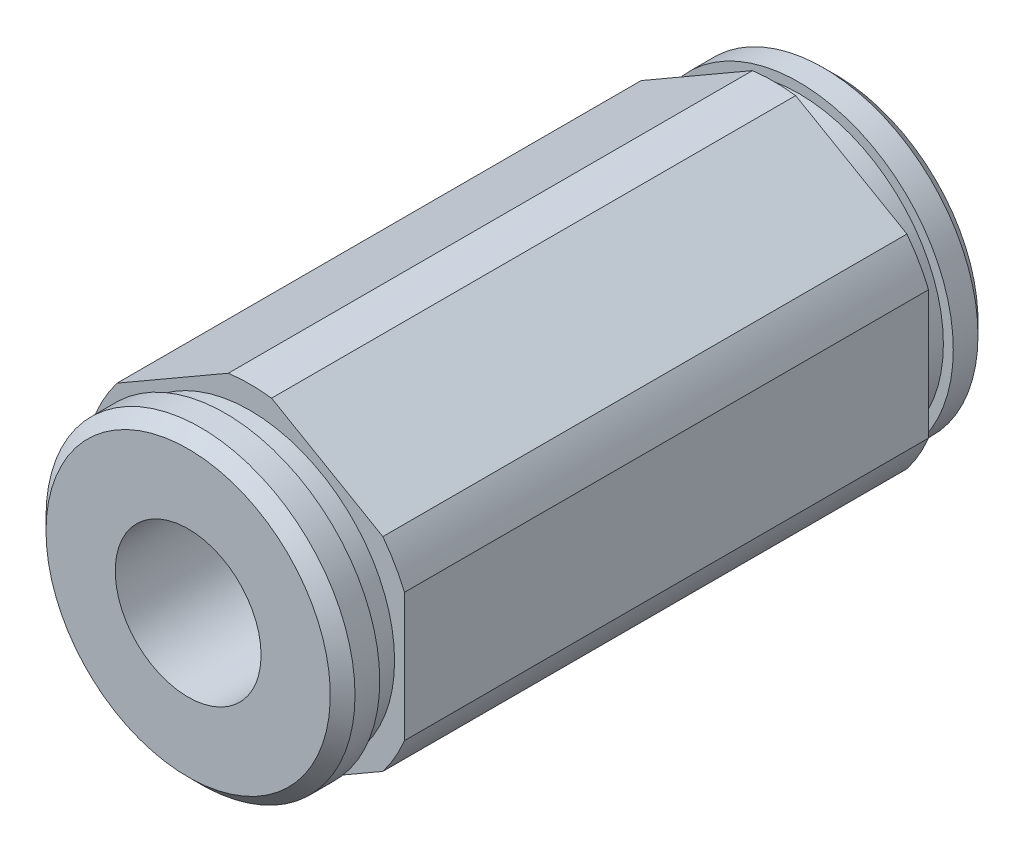
ISO-10303-21;
HEADER;
FILE_DESCRIPTION(('STEP AP214'),'2;1');
FILE_NAME('part.step','',(''),(''),'','','');
FILE_SCHEMA(('AUTOMOTIVE_DESIGN { 1 0 10303 214 1 1 1 1 }'));
ENDSEC;
DATA;
#1=APPLICATION_CONTEXT('core data for automotive mechanical design processes');
#2=APPLICATION_PROTOCOL_DEFINITION('international standard','automotive_design',2000,#1);
#3=PRODUCT_CONTEXT('',#1,'mechanical');
#4=PRODUCT('Part','Part','',(#3));
#5=PRODUCT_RELATED_PRODUCT_CATEGORY('part','',(#4));
#6=PRODUCT_DEFINITION_FORMATION('','',#4);
#7=PRODUCT_DEFINITION_CONTEXT('part definition',#1,'design');
#8=PRODUCT_DEFINITION('design','',#6,#7);
#9=PRODUCT_DEFINITION_SHAPE('','',#8);
#10=(LENGTH_UNIT() NAMED_UNIT(*) SI_UNIT(.MILLI.,.METRE.));
#11=(NAMED_UNIT(*) PLANE_ANGLE_UNIT() SI_UNIT($,.RADIAN.));
#12=(NAMED_UNIT(*) SI_UNIT($,.STERADIAN.) SOLID_ANGLE_UNIT());
#13=UNCERTAINTY_MEASURE_WITH_UNIT(LENGTH_MEASURE(1.E-05),#10,'distance_accuracy_value','');
#14=(GEOMETRIC_REPRESENTATION_CONTEXT(3) GLOBAL_UNCERTAINTY_ASSIGNED_CONTEXT((#13)) GLOBAL_UNIT_ASSIGNED_CONTEXT((#10,
#11,#12)) REPRESENTATION_CONTEXT('',''));
#15=CARTESIAN_POINT('',(0.,0.,0.));
#16=DIRECTION('',(0.,0.,1.));
#17=DIRECTION('',(1.,0.,0.));
#18=AXIS2_PLACEMENT_3D('',#15,#16,#17);
#19=CARTESIAN_POINT('',(0.,0.,10.7696));
#20=DIRECTION('',(0.,0.,1.));
#21=DIRECTION('',(1.,0.,0.));
#22=AXIS2_PLACEMENT_3D('',#19,#20,#21);
#23=PLANE('',#22);
#24=CARTESIAN_POINT('',(0.,0.,10.7696));
#25=DIRECTION('',(0.,0.,-1.));
#26=DIRECTION('',(-1.,0.,0.));
#27=AXIS2_PLACEMENT_3D('',#24,#25,#26);
#28=CIRCLE('',#27,5.9436);
#29=CARTESIAN_POINT('',(-5.9436,0.,10.7696));
#30=VERTEX_POINT('',#29);
#31=EDGE_CURVE('E163',#30,#30,#28,.T.);
#32=ORIENTED_EDGE('',*,*,#31,.T.);
#33=EDGE_LOOP('',(#32));
#34=FACE_BOUND('',#33,.T.);
#35=CARTESIAN_POINT('',(0.,0.,10.7696));
#36=DIRECTION('',(0.,0.,1.));
#37=DIRECTION('',(1.,0.,0.));
#38=AXIS2_PLACEMENT_3D('',#35,#36,#37);
#39=CIRCLE('',#38,6.87705);
#40=CARTESIAN_POINT('',(5.46158862213451,-4.17909875751589,10.7696));
#41=VERTEX_POINT('',#40);
#42=CARTESIAN_POINT('',(6.35,-2.64032511303059,10.7696));
#43=VERTEX_POINT('',#42);
#44=EDGE_CURVE('E140',#41,#43,#39,.T.);
#45=ORIENTED_EDGE('',*,*,#44,.T.);
#46=DIRECTION('',(0.,1.,0.));
#47=VECTOR('',#46,1.);
#48=CARTESIAN_POINT('',(6.35,-2.64032511303059,10.7696));
#49=LINE('',#48,#47);
#50=CARTESIAN_POINT('',(6.35,2.64032511303059,10.7696));
#51=VERTEX_POINT('',#50);
#52=EDGE_CURVE('E134',#43,#51,#49,.T.);
#53=ORIENTED_EDGE('',*,*,#52,.T.);
#54=CARTESIAN_POINT('',(0.,0.,10.7696));
#55=DIRECTION('',(0.,0.,1.));
#56=DIRECTION('',(1.,0.,0.));
#57=AXIS2_PLACEMENT_3D('',#54,#55,#56);
#58=CIRCLE('',#57,6.87705);
#59=CARTESIAN_POINT('',(5.46158862213451,4.17909875751589,10.7696));
#60=VERTEX_POINT('',#59);
#61=EDGE_CURVE('E137',#51,#60,#58,.T.);
#62=ORIENTED_EDGE('',*,*,#61,.T.);
#63=DIRECTION('',(-0.866025403784439,0.499999999999999,0.));
#64=VECTOR('',#63,1.);
#65=CARTESIAN_POINT('',(5.46158862213451,4.17909875751589,10.7696));
#66=LINE('',#65,#64);
#67=CARTESIAN_POINT('',(0.888411377865485,6.81942387054648,10.7696));
#68=VERTEX_POINT('',#67);
#69=EDGE_CURVE('E55',#60,#68,#66,.T.);
#70=ORIENTED_EDGE('',*,*,#69,.T.);
#71=CARTESIAN_POINT('',(0.,0.,10.7696));
#72=DIRECTION('',(0.,0.,1.));
#73=DIRECTION('',(1.,0.,0.));
#74=AXIS2_PLACEMENT_3D('',#71,#72,#73);
#75=CIRCLE('',#74,6.87705);
#76=CARTESIAN_POINT('',(-0.88841137786549,6.81942387054648,10.7696));
#77=VERTEX_POINT('',#76);
#78=EDGE_CURVE('E187',#68,#77,#75,.T.);
#79=ORIENTED_EDGE('',*,*,#78,.T.);
#80=DIRECTION('',(-0.866025403784439,-0.5,0.));
#81=VECTOR('',#80,1.);
#82=CARTESIAN_POINT('',(-0.88841137786549,6.81942387054648,10.7696));
#83=LINE('',#82,#81);
#84=CARTESIAN_POINT('',(-5.46158862213451,4.17909875751589,10.7696));
#85=VERTEX_POINT('',#84);
#86=EDGE_CURVE('E109',#77,#85,#83,.T.);
#87=ORIENTED_EDGE('',*,*,#86,.T.);
#88=CARTESIAN_POINT('',(0.,0.,10.7696));
#89=DIRECTION('',(0.,0.,1.));
#90=DIRECTION('',(1.,0.,0.));
#91=AXIS2_PLACEMENT_3D('',#88,#89,#90);
#92=CIRCLE('',#91,6.87705);
#93=CARTESIAN_POINT('',(-6.35,2.64032511303059,10.7696));
#94=VERTEX_POINT('',#93);
#95=EDGE_CURVE('E229',#85,#94,#92,.T.);
#96=ORIENTED_EDGE('',*,*,#95,.T.);
#97=DIRECTION('',(0.,-1.,0.));
#98=VECTOR('',#97,1.);
#99=CARTESIAN_POINT('',(-6.35,2.64032511303059,10.7696));
#100=LINE('',#99,#98);
#101=CARTESIAN_POINT('',(-6.35,-2.64032511303059,10.7696));
#102=VERTEX_POINT('',#101);
#103=EDGE_CURVE('E226',#94,#102,#100,.T.);
#104=ORIENTED_EDGE('',*,*,#103,.T.);
#105=CARTESIAN_POINT('',(0.,0.,10.7696));
#106=DIRECTION('',(0.,0.,1.));
#107=DIRECTION('',(1.,0.,0.));
#108=AXIS2_PLACEMENT_3D('',#105,#106,#107);
#109=CIRCLE('',#108,6.87705);
#110=CARTESIAN_POINT('',(-5.46158862213451,-4.17909875751589,10.7696));
#111=VERTEX_POINT('',#110);
#112=EDGE_CURVE('E228',#102,#111,#109,.T.);
#113=ORIENTED_EDGE('',*,*,#112,.T.);
#114=DIRECTION('',(0.866025403784438,-0.5,0.));
#115=VECTOR('',#114,1.);
#116=CARTESIAN_POINT('',(-5.46158862213451,-4.17909875751589,10.7696));
#117=LINE('',#116,#115);
#118=CARTESIAN_POINT('',(-0.888411377865495,-6.81942387054648,10.7696));
#119=VERTEX_POINT('',#118);
#120=EDGE_CURVE('E231',#111,#119,#117,.T.);
#121=ORIENTED_EDGE('',*,*,#120,.T.);
#122=CARTESIAN_POINT('',(0.,0.,10.7696));
#123=DIRECTION('',(0.,0.,1.));
#124=DIRECTION('',(1.,0.,0.));
#125=AXIS2_PLACEMENT_3D('',#122,#123,#124);
#126=CIRCLE('',#125,6.87705);
#127=CARTESIAN_POINT('',(0.888411377865487,-6.81942387054648,10.7696));
#128=VERTEX_POINT('',#127);
#129=EDGE_CURVE('E237',#119,#128,#126,.T.);
#130=ORIENTED_EDGE('',*,*,#129,.T.);
#131=DIRECTION('',(0.866025403784439,0.5,0.));
#132=VECTOR('',#131,1.);
#133=CARTESIAN_POINT('',(0.88841137786549,-6.81942387054648,10.7696));
#134=LINE('',#133,#132);
#135=EDGE_CURVE('E239',#128,#41,#134,.T.);
#136=ORIENTED_EDGE('',*,*,#135,.T.);
#137=EDGE_LOOP('',(#45,#53,#62,#70,#79,#87,#96,#104,#113,#121,#130,#136));
#138=FACE_BOUND('',#137,.T.);
#139=ADVANCED_FACE('F38',(#34,#138),#23,.T.);
#140=CARTESIAN_POINT('',(-0.88841137786549,6.81942387054648,10.7696));
#141=DIRECTION('',(0.5,-0.866025403784439,0.));
#142=DIRECTION('',(0.866025403784439,0.5,0.));
#143=AXIS2_PLACEMENT_3D('',#140,#141,#142);
#144=PLANE('',#143);
#145=DIRECTION('',(0.,0.,-1.));
#146=VECTOR('',#145,1.);
#147=CARTESIAN_POINT('',(-5.46158862213451,4.17909875751589,10.7696));
#148=LINE('',#147,#146);
#149=CARTESIAN_POINT('',(-5.46158862213451,4.17909875751589,-10.7696));
#150=VERTEX_POINT('',#149);
#151=EDGE_CURVE('E208',#85,#150,#148,.T.);
#152=ORIENTED_EDGE('',*,*,#151,.F.);
#153=ORIENTED_EDGE('',*,*,#86,.F.);
#154=DIRECTION('',(0.,0.,-1.));
#155=VECTOR('',#154,1.);
#156=CARTESIAN_POINT('',(-0.88841137786549,6.81942387054648,10.7696));
#157=LINE('',#156,#155);
#158=CARTESIAN_POINT('',(-0.88841137786549,6.81942387054648,-10.7696));
#159=VERTEX_POINT('',#158);
#160=EDGE_CURVE('E41',#77,#159,#157,.T.);
#161=ORIENTED_EDGE('',*,*,#160,.T.);
#162=DIRECTION('',(-0.866025403784439,-0.5,0.));
#163=VECTOR('',#162,1.);
#164=CARTESIAN_POINT('',(-0.88841137786549,6.81942387054648,-10.7696));
#165=LINE('',#164,#163);
#166=EDGE_CURVE('E162',#159,#150,#165,.T.);
#167=ORIENTED_EDGE('',*,*,#166,.T.);
#168=EDGE_LOOP('',(#152,#153,#161,#167));
#169=FACE_BOUND('',#168,.T.);
#170=ADVANCED_FACE('F214',(#169),#144,.F.);
#171=CARTESIAN_POINT('',(-6.35,2.64032511303059,10.7696));
#172=DIRECTION('',(1.,0.,0.));
#173=DIRECTION('',(0.,0.,-1.));
#174=AXIS2_PLACEMENT_3D('',#171,#172,#173);
#175=PLANE('',#174);
#176=DIRECTION('',(0.,0.,-1.));
#177=VECTOR('',#176,1.);
#178=CARTESIAN_POINT('',(-6.35,-2.64032511303059,10.7696));
#179=LINE('',#178,#177);
#180=CARTESIAN_POINT('',(-6.35,-2.64032511303059,-10.7696));
#181=VERTEX_POINT('',#180);
#182=EDGE_CURVE('E203',#102,#181,#179,.T.);
#183=ORIENTED_EDGE('',*,*,#182,.F.);
#184=ORIENTED_EDGE('',*,*,#103,.F.);
#185=DIRECTION('',(0.,0.,-1.));
#186=VECTOR('',#185,1.);
#187=CARTESIAN_POINT('',(-6.35,2.64032511303059,10.7696));
#188=LINE('',#187,#186);
#189=CARTESIAN_POINT('',(-6.35,2.64032511303059,-10.7696));
#190=VERTEX_POINT('',#189);
#191=EDGE_CURVE('E206',#94,#190,#188,.T.);
#192=ORIENTED_EDGE('',*,*,#191,.T.);
#193=DIRECTION('',(0.,-1.,0.));
#194=VECTOR('',#193,1.);
#195=CARTESIAN_POINT('',(-6.35,2.64032511303059,-10.7696));
#196=LINE('',#195,#194);
#197=EDGE_CURVE('E168',#190,#181,#196,.T.);
#198=ORIENTED_EDGE('',*,*,#197,.T.);
#199=EDGE_LOOP('',(#183,#184,#192,#198));
#200=FACE_BOUND('',#199,.T.);
#201=ADVANCED_FACE('F225',(#200),#175,.F.);
#202=CARTESIAN_POINT('',(-5.46158862213451,-4.17909875751589,10.7696));
#203=DIRECTION('',(0.5,0.866025403784439,0.));
#204=DIRECTION('',(-0.866025403784439,0.5,0.));
#205=AXIS2_PLACEMENT_3D('',#202,#203,#204);
#206=PLANE('',#205);
#207=DIRECTION('',(0.,0.,-1.));
#208=VECTOR('',#207,1.);
#209=CARTESIAN_POINT('',(-0.888411377865495,-6.81942387054648,10.7696));
#210=LINE('',#209,#208);
#211=CARTESIAN_POINT('',(-0.888411377865495,-6.81942387054648,-10.7696));
#212=VERTEX_POINT('',#211);
#213=EDGE_CURVE('E197',#119,#212,#210,.T.);
#214=ORIENTED_EDGE('',*,*,#213,.F.);
#215=ORIENTED_EDGE('',*,*,#120,.F.);
#216=DIRECTION('',(0.,0.,-1.));
#217=VECTOR('',#216,1.);
#218=CARTESIAN_POINT('',(-5.46158862213451,-4.17909875751589,10.7696));
#219=LINE('',#218,#217);
#220=CARTESIAN_POINT('',(-5.46158862213451,-4.17909875751589,-10.7696));
#221=VERTEX_POINT('',#220);
#222=EDGE_CURVE('E200',#111,#221,#219,.T.);
#223=ORIENTED_EDGE('',*,*,#222,.T.);
#224=DIRECTION('',(0.866025403784438,-0.5,0.));
#225=VECTOR('',#224,1.);
#226=CARTESIAN_POINT('',(-5.46158862213451,-4.17909875751589,-10.7696));
#227=LINE('',#226,#225);
#228=EDGE_CURVE('E173',#221,#212,#227,.T.);
#229=ORIENTED_EDGE('',*,*,#228,.T.);
#230=EDGE_LOOP('',(#214,#215,#223,#229));
#231=FACE_BOUND('',#230,.T.);
#232=ADVANCED_FACE('F327',(#231),#206,.F.);
#233=CARTESIAN_POINT('',(0.88841137786549,-6.81942387054648,10.7696));
#234=DIRECTION('',(-0.5,0.866025403784439,0.));
#235=DIRECTION('',(-0.866025403784439,-0.5,0.));
#236=AXIS2_PLACEMENT_3D('',#233,#234,#235);
#237=PLANE('',#236);
#238=DIRECTION('',(0.,0.,-1.));
#239=VECTOR('',#238,1.);
#240=CARTESIAN_POINT('',(5.46158862213451,-4.17909875751589,10.7696));
#241=LINE('',#240,#239);
#242=CARTESIAN_POINT('',(5.46158862213451,-4.17909875751589,-10.7696));
#243=VERTEX_POINT('',#242);
#244=EDGE_CURVE('E191',#41,#243,#241,.T.);
#245=ORIENTED_EDGE('',*,*,#244,.F.);
#246=ORIENTED_EDGE('',*,*,#135,.F.);
#247=DIRECTION('',(0.,0.,-1.));
#248=VECTOR('',#247,1.);
#249=CARTESIAN_POINT('',(0.888411377865487,-6.81942387054648,10.7696));
#250=LINE('',#249,#248);
#251=CARTESIAN_POINT('',(0.888411377865487,-6.81942387054648,-10.7696));
#252=VERTEX_POINT('',#251);
#253=EDGE_CURVE('E194',#128,#252,#250,.T.);
#254=ORIENTED_EDGE('',*,*,#253,.T.);
#255=DIRECTION('',(0.866025403784439,0.5,0.));
#256=VECTOR('',#255,1.);
#257=CARTESIAN_POINT('',(0.88841137786549,-6.81942387054648,-10.7696));
#258=LINE('',#257,#256);
#259=EDGE_CURVE('E178',#252,#243,#258,.T.);
#260=ORIENTED_EDGE('',*,*,#259,.T.);
#261=EDGE_LOOP('',(#245,#246,#254,#260));
#262=FACE_BOUND('',#261,.T.);
#263=ADVANCED_FACE('F245',(#262),#237,.F.);
#264=CARTESIAN_POINT('',(6.35,-2.64032511303059,10.7696));
#265=DIRECTION('',(-1.,0.,0.));
#266=DIRECTION('',(0.,0.,1.));
#267=AXIS2_PLACEMENT_3D('',#264,#265,#266);
#268=PLANE('',#267);
#269=ORIENTED_EDGE('',*,*,#52,.F.);
#270=DIRECTION('',(0.,0.,-1.));
#271=VECTOR('',#270,1.);
#272=CARTESIAN_POINT('',(6.35,-2.64032511303059,10.7696));
#273=LINE('',#272,#271);
#274=CARTESIAN_POINT('',(6.35,-2.64032511303059,-10.7696));
#275=VERTEX_POINT('',#274);
#276=EDGE_CURVE('E150',#43,#275,#273,.T.);
#277=ORIENTED_EDGE('',*,*,#276,.T.);
#278=DIRECTION('',(0.,1.,0.));
#279=VECTOR('',#278,1.);
#280=CARTESIAN_POINT('',(6.35,-2.64032511303059,-10.7696));
#281=LINE('',#280,#279);
#282=CARTESIAN_POINT('',(6.35,2.64032511303059,-10.7696));
#283=VERTEX_POINT('',#282);
#284=EDGE_CURVE('E148',#275,#283,#281,.T.);
#285=ORIENTED_EDGE('',*,*,#284,.T.);
#286=DIRECTION('',(0.,0.,-1.));
#287=VECTOR('',#286,1.);
#288=CARTESIAN_POINT('',(6.35,2.64032511303059,10.7696));
#289=LINE('',#288,#287);
#290=EDGE_CURVE('E146',#51,#283,#289,.T.);
#291=ORIENTED_EDGE('',*,*,#290,.F.);
#292=EDGE_LOOP('',(#269,#277,#285,#291));
#293=FACE_BOUND('',#292,.T.);
#294=ADVANCED_FACE('F147',(#293),#268,.F.);
#295=CARTESIAN_POINT('',(5.46158862213451,4.17909875751589,10.7696));
#296=DIRECTION('',(-0.499999999999999,-0.866025403784439,0.));
#297=DIRECTION('',(0.866025403784439,-0.499999999999999,0.));
#298=AXIS2_PLACEMENT_3D('',#295,#296,#297);
#299=PLANE('',#298);
#300=DIRECTION('',(0.,0.,-1.));
#301=VECTOR('',#300,1.);
#302=CARTESIAN_POINT('',(0.888411377865485,6.81942387054648,10.7696));
#303=LINE('',#302,#301);
#304=CARTESIAN_POINT('',(0.888411377865485,6.81942387054648,-10.7696));
#305=VERTEX_POINT('',#304);
#306=EDGE_CURVE('E155',#68,#305,#303,.T.);
#307=ORIENTED_EDGE('',*,*,#306,.F.);
#308=ORIENTED_EDGE('',*,*,#69,.F.);
#309=DIRECTION('',(0.,0.,-1.));
#310=VECTOR('',#309,1.);
#311=CARTESIAN_POINT('',(5.46158862213451,4.17909875751589,10.7696));
#312=LINE('',#311,#310);
#313=CARTESIAN_POINT('',(5.46158862213451,4.17909875751589,-10.7696));
#314=VERTEX_POINT('',#313);
#315=EDGE_CURVE('E151',#60,#314,#312,.T.);
#316=ORIENTED_EDGE('',*,*,#315,.T.);
#317=DIRECTION('',(-0.866025403784439,0.499999999999999,0.));
#318=VECTOR('',#317,1.);
#319=CARTESIAN_POINT('',(5.46158862213451,4.17909875751589,-10.7696));
#320=LINE('',#319,#318);
#321=EDGE_CURVE('E96',#314,#305,#320,.T.);
#322=ORIENTED_EDGE('',*,*,#321,.T.);
#323=EDGE_LOOP('',(#307,#308,#316,#322));
#324=FACE_BOUND('',#323,.T.);
#325=ADVANCED_FACE('F250',(#324),#299,.F.);
#326=CARTESIAN_POINT('',(0.,0.,10.7696));
#327=DIRECTION('',(0.,0.,-1.));
#328=DIRECTION('',(-1.,0.,0.));
#329=AXIS2_PLACEMENT_3D('',#326,#327,#328);
#330=CYLINDRICAL_SURFACE('',#329,6.87705);
#331=CARTESIAN_POINT('',(0.,0.,-10.7696));
#332=DIRECTION('',(0.,0.,1.));
#333=DIRECTION('',(1.,0.,0.));
#334=AXIS2_PLACEMENT_3D('',#331,#332,#333);
#335=CIRCLE('',#334,6.87705);
#336=EDGE_CURVE('E159',#305,#159,#335,.T.);
#337=ORIENTED_EDGE('',*,*,#336,.T.);
#338=ORIENTED_EDGE('',*,*,#160,.F.);
#339=ORIENTED_EDGE('',*,*,#78,.F.);
#340=ORIENTED_EDGE('',*,*,#306,.T.);
#341=EDGE_LOOP('',(#337,#338,#339,#340));
#342=FACE_BOUND('',#341,.T.);
#343=ADVANCED_FACE('F217',(#342),#330,.T.);
#344=CARTESIAN_POINT('',(0.,0.,10.7696));
#345=DIRECTION('',(0.,0.,-1.));
#346=DIRECTION('',(-1.,0.,0.));
#347=AXIS2_PLACEMENT_3D('',#344,#345,#346);
#348=CYLINDRICAL_SURFACE('',#347,6.87705);
#349=CARTESIAN_POINT('',(0.,0.,-10.7696));
#350=DIRECTION('',(0.,0.,1.));
#351=DIRECTION('',(1.,0.,0.));
#352=AXIS2_PLACEMENT_3D('',#349,#350,#351);
#353=CIRCLE('',#352,6.87705);
#354=EDGE_CURVE('E165',#150,#190,#353,.T.);
#355=ORIENTED_EDGE('',*,*,#354,.T.);
#356=ORIENTED_EDGE('',*,*,#191,.F.);
#357=ORIENTED_EDGE('',*,*,#95,.F.);
#358=ORIENTED_EDGE('',*,*,#151,.T.);
#359=EDGE_LOOP('',(#355,#356,#357,#358));
#360=FACE_BOUND('',#359,.T.);
#361=ADVANCED_FACE('F221',(#360),#348,.T.);
#362=CARTESIAN_POINT('',(0.,0.,10.7696));
#363=DIRECTION('',(0.,0.,-1.));
#364=DIRECTION('',(-1.,0.,0.));
#365=AXIS2_PLACEMENT_3D('',#362,#363,#364);
#366=CYLINDRICAL_SURFACE('',#365,6.87705);
#367=CARTESIAN_POINT('',(0.,0.,-10.7696));
#368=DIRECTION('',(0.,0.,1.));
#369=DIRECTION('',(1.,0.,0.));
#370=AXIS2_PLACEMENT_3D('',#367,#368,#369);
#371=CIRCLE('',#370,6.87705);
#372=EDGE_CURVE('E170',#181,#221,#371,.T.);
#373=ORIENTED_EDGE('',*,*,#372,.T.);
#374=ORIENTED_EDGE('',*,*,#222,.F.);
#375=ORIENTED_EDGE('',*,*,#112,.F.);
#376=ORIENTED_EDGE('',*,*,#182,.T.);
#377=EDGE_LOOP('',(#373,#374,#375,#376));
#378=FACE_BOUND('',#377,.T.);
#379=ADVANCED_FACE('F364',(#378),#366,.T.);
#380=CARTESIAN_POINT('',(0.,0.,10.7696));
#381=DIRECTION('',(0.,0.,-1.));
#382=DIRECTION('',(-1.,0.,0.));
#383=AXIS2_PLACEMENT_3D('',#380,#381,#382);
#384=CYLINDRICAL_SURFACE('',#383,6.87705);
#385=CARTESIAN_POINT('',(0.,0.,-10.7696));
#386=DIRECTION('',(0.,0.,1.));
#387=DIRECTION('',(1.,0.,0.));
#388=AXIS2_PLACEMENT_3D('',#385,#386,#387);
#389=CIRCLE('',#388,6.87705);
#390=EDGE_CURVE('E175',#212,#252,#389,.T.);
#391=ORIENTED_EDGE('',*,*,#390,.T.);
#392=ORIENTED_EDGE('',*,*,#253,.F.);
#393=ORIENTED_EDGE('',*,*,#129,.F.);
#394=ORIENTED_EDGE('',*,*,#213,.T.);
#395=EDGE_LOOP('',(#391,#392,#393,#394));
#396=FACE_BOUND('',#395,.T.);
#397=ADVANCED_FACE('F359',(#396),#384,.T.);
#398=CARTESIAN_POINT('',(0.,0.,10.7696));
#399=DIRECTION('',(0.,0.,-1.));
#400=DIRECTION('',(-1.,0.,0.));
#401=AXIS2_PLACEMENT_3D('',#398,#399,#400);
#402=CYLINDRICAL_SURFACE('',#401,6.87705);
#403=CARTESIAN_POINT('',(0.,0.,-10.7696));
#404=DIRECTION('',(0.,0.,1.));
#405=DIRECTION('',(1.,0.,0.));
#406=AXIS2_PLACEMENT_3D('',#403,#404,#405);
#407=CIRCLE('',#406,6.87705);
#408=EDGE_CURVE('E180',#243,#275,#407,.T.);
#409=ORIENTED_EDGE('',*,*,#408,.T.);
#410=ORIENTED_EDGE('',*,*,#276,.F.);
#411=ORIENTED_EDGE('',*,*,#44,.F.);
#412=ORIENTED_EDGE('',*,*,#244,.T.);
#413=EDGE_LOOP('',(#409,#410,#411,#412));
#414=FACE_BOUND('',#413,.T.);
#415=ADVANCED_FACE('F248',(#414),#402,.T.);
#416=CARTESIAN_POINT('',(0.,0.,10.7696));
#417=DIRECTION('',(0.,0.,-1.));
#418=DIRECTION('',(-1.,0.,0.));
#419=AXIS2_PLACEMENT_3D('',#416,#417,#418);
#420=CYLINDRICAL_SURFACE('',#419,6.87705);
#421=CARTESIAN_POINT('',(0.,0.,-10.7696));
#422=DIRECTION('',(0.,0.,1.));
#423=DIRECTION('',(1.,0.,0.));
#424=AXIS2_PLACEMENT_3D('',#421,#422,#423);
#425=CIRCLE('',#424,6.87705);
#426=EDGE_CURVE('E184',#283,#314,#425,.T.);
#427=ORIENTED_EDGE('',*,*,#426,.T.);
#428=ORIENTED_EDGE('',*,*,#315,.F.);
#429=ORIENTED_EDGE('',*,*,#61,.F.);
#430=ORIENTED_EDGE('',*,*,#290,.T.);
#431=EDGE_LOOP('',(#427,#428,#429,#430));
#432=FACE_BOUND('',#431,.T.);
#433=ADVANCED_FACE('F153',(#432),#420,.T.);
#434=CARTESIAN_POINT('',(0.,0.,-10.7696));
#435=DIRECTION('',(0.,0.,1.));
#436=DIRECTION('',(1.,0.,0.));
#437=AXIS2_PLACEMENT_3D('',#434,#435,#436);
#438=PLANE('',#437);
#439=CARTESIAN_POINT('',(0.,0.,-10.7696));
#440=DIRECTION('',(0.,0.,-1.));
#441=DIRECTION('',(-1.,0.,0.));
#442=AXIS2_PLACEMENT_3D('',#439,#440,#441);
#443=CIRCLE('',#442,5.9436);
#444=CARTESIAN_POINT('',(-5.9436,0.,-10.7696));
#445=VERTEX_POINT('',#444);
#446=EDGE_CURVE('E11',#445,#445,#443,.T.);
#447=ORIENTED_EDGE('',*,*,#446,.F.);
#448=EDGE_LOOP('',(#447));
#449=FACE_BOUND('',#448,.T.);
#450=ORIENTED_EDGE('',*,*,#321,.F.);
#451=ORIENTED_EDGE('',*,*,#426,.F.);
#452=ORIENTED_EDGE('',*,*,#284,.F.);
#453=ORIENTED_EDGE('',*,*,#408,.F.);
#454=ORIENTED_EDGE('',*,*,#259,.F.);
#455=ORIENTED_EDGE('',*,*,#390,.F.);
#456=ORIENTED_EDGE('',*,*,#228,.F.);
#457=ORIENTED_EDGE('',*,*,#372,.F.);
#458=ORIENTED_EDGE('',*,*,#197,.F.);
#459=ORIENTED_EDGE('',*,*,#354,.F.);
#460=ORIENTED_EDGE('',*,*,#166,.F.);
#461=ORIENTED_EDGE('',*,*,#336,.F.);
#462=EDGE_LOOP('',(#450,#451,#452,#453,#454,#455,#456,#457,#458,#459,#460,#461));
#463=FACE_BOUND('',#462,.T.);
#464=ADVANCED_FACE('F218',(#449,#463),#438,.F.);
#465=CARTESIAN_POINT('',(0.,0.,-38.2778));
#466=DIRECTION('',(0.,0.,-1.));
#467=DIRECTION('',(-1.,0.,0.));
#468=AXIS2_PLACEMENT_3D('',#465,#466,#467);
#469=CYLINDRICAL_SURFACE('',#468,5.9436);
#470=CARTESIAN_POINT('',(0.,0.,11.7856));
#471=DIRECTION('',(0.,0.,-1.));
#472=DIRECTION('',(-1.,0.,0.));
#473=AXIS2_PLACEMENT_3D('',#470,#471,#472);
#474=CIRCLE('',#473,5.9436);
#475=CARTESIAN_POINT('',(-5.9436,0.,11.7856));
#476=VERTEX_POINT('',#475);
#477=EDGE_CURVE('E255',#476,#476,#474,.T.);
#478=ORIENTED_EDGE('',*,*,#477,.T.);
#479=EDGE_LOOP('',(#478));
#480=FACE_BOUND('',#479,.T.);
#481=ORIENTED_EDGE('',*,*,#31,.F.);
#482=EDGE_LOOP('',(#481));
#483=FACE_BOUND('',#482,.T.);
#484=ADVANCED_FACE('F310',(#480,#483),#469,.T.);
#485=CARTESIAN_POINT('',(0.,5.9436,11.7856));
#486=DIRECTION('',(0.,0.,-1.));
#487=DIRECTION('',(-1.,0.,0.));
#488=AXIS2_PLACEMENT_3D('',#485,#486,#487);
#489=PLANE('',#488);
#490=CARTESIAN_POINT('',(0.,0.,11.7856));
#491=DIRECTION('',(0.,0.,-1.));
#492=DIRECTION('',(-1.,0.,0.));
#493=AXIS2_PLACEMENT_3D('',#490,#491,#492);
#494=CIRCLE('',#493,6.35);
#495=CARTESIAN_POINT('',(-6.35,0.,11.7856));
#496=VERTEX_POINT('',#495);
#497=EDGE_CURVE('E258',#496,#496,#494,.T.);
#498=ORIENTED_EDGE('',*,*,#497,.T.);
#499=EDGE_LOOP('',(#498));
#500=FACE_BOUND('',#499,.T.);
#501=ORIENTED_EDGE('',*,*,#477,.F.);
#502=EDGE_LOOP('',(#501));
#503=FACE_BOUND('',#502,.T.);
#504=ADVANCED_FACE('F304',(#500,#503),#489,.T.);
#505=CARTESIAN_POINT('',(0.,0.,-38.2778));
#506=DIRECTION('',(0.,0.,-1.));
#507=DIRECTION('',(-1.,0.,0.));
#508=AXIS2_PLACEMENT_3D('',#505,#506,#507);
#509=CYLINDRICAL_SURFACE('',#508,6.35);
#510=CARTESIAN_POINT('',(0.,0.,12.8016));
#511=DIRECTION('',(0.,0.,-1.));
#512=DIRECTION('',(-1.,0.,0.));
#513=AXIS2_PLACEMENT_3D('',#510,#511,#512);
#514=CIRCLE('',#513,6.35);
#515=CARTESIAN_POINT('',(-6.35,0.,12.8016));
#516=VERTEX_POINT('',#515);
#517=EDGE_CURVE('E261',#516,#516,#514,.T.);
#518=ORIENTED_EDGE('',*,*,#517,.T.);
#519=EDGE_LOOP('',(#518));
#520=FACE_BOUND('',#519,.T.);
#521=ORIENTED_EDGE('',*,*,#497,.F.);
#522=EDGE_LOOP('',(#521));
#523=FACE_BOUND('',#522,.T.);
#524=ADVANCED_FACE('F298',(#520,#523),#509,.T.);
#525=CARTESIAN_POINT('',(0.,0.,12.8016));
#526=DIRECTION('',(0.,0.,-1.));
#527=DIRECTION('',(-1.,0.,0.));
#528=AXIS2_PLACEMENT_3D('',#525,#526,#527);
#529=CONICAL_SURFACE('',#528,6.35,0.785398163397447);
#530=CARTESIAN_POINT('',(0.,0.,13.3096));
#531=DIRECTION('',(0.,0.,-1.));
#532=DIRECTION('',(-1.,0.,0.));
#533=AXIS2_PLACEMENT_3D('',#530,#531,#532);
#534=CIRCLE('',#533,5.842);
#535=CARTESIAN_POINT('',(-5.842,0.,13.3096));
#536=VERTEX_POINT('',#535);
#537=EDGE_CURVE('E264',#536,#536,#534,.T.);
#538=ORIENTED_EDGE('',*,*,#537,.T.);
#539=EDGE_LOOP('',(#538));
#540=FACE_BOUND('',#539,.T.);
#541=ORIENTED_EDGE('',*,*,#517,.F.);
#542=EDGE_LOOP('',(#541));
#543=FACE_BOUND('',#542,.T.);
#544=ADVANCED_FACE('F292',(#540,#543),#529,.T.);
#545=CARTESIAN_POINT('',(0.,5.842,13.3096));
#546=DIRECTION('',(0.,0.,1.));
#547=DIRECTION('',(1.,0.,0.));
#548=AXIS2_PLACEMENT_3D('',#545,#546,#547);
#549=PLANE('',#548);
#550=CARTESIAN_POINT('',(0.,0.,13.3096));
#551=DIRECTION('',(0.,0.,1.));
#552=DIRECTION('',(1.,0.,0.));
#553=AXIS2_PLACEMENT_3D('',#550,#551,#552);
#554=CIRCLE('',#553,2.9972);
#555=CARTESIAN_POINT('',(2.9972,0.,13.3096));
#556=VERTEX_POINT('',#555);
#557=EDGE_CURVE('E282',#556,#556,#554,.T.);
#558=ORIENTED_EDGE('',*,*,#557,.F.);
#559=EDGE_LOOP('',(#558));
#560=FACE_BOUND('',#559,.T.);
#561=ORIENTED_EDGE('',*,*,#537,.F.);
#562=EDGE_LOOP('',(#561));
#563=FACE_BOUND('',#562,.T.);
#564=ADVANCED_FACE('F288',(#560,#563),#549,.T.);
#565=CARTESIAN_POINT('',(0.,0.,38.2778));
#566=DIRECTION('',(0.,0.,1.));
#567=DIRECTION('',(-1.,0.,0.));
#568=AXIS2_PLACEMENT_3D('',#565,#566,#567);
#569=CYLINDRICAL_SURFACE('',#568,5.9436);
#570=CARTESIAN_POINT('',(0.,0.,-11.7856));
#571=DIRECTION('',(0.,0.,-1.));
#572=DIRECTION('',(-1.,0.,0.));
#573=AXIS2_PLACEMENT_3D('',#570,#571,#572);
#574=CIRCLE('',#573,5.9436);
#575=CARTESIAN_POINT('',(-5.9436,0.,-11.7856));
#576=VERTEX_POINT('',#575);
#577=EDGE_CURVE('E266',#576,#576,#574,.T.);
#578=ORIENTED_EDGE('',*,*,#577,.F.);
#579=EDGE_LOOP('',(#578));
#580=FACE_BOUND('',#579,.T.);
#581=ORIENTED_EDGE('',*,*,#446,.T.);
#582=EDGE_LOOP('',(#581));
#583=FACE_BOUND('',#582,.T.);
#584=ADVANCED_FACE('F291',(#580,#583),#569,.T.);
#585=CARTESIAN_POINT('',(0.,5.9436,-11.7856));
#586=DIRECTION('',(0.,0.,1.));
#587=DIRECTION('',(-1.,0.,0.));
#588=AXIS2_PLACEMENT_3D('',#585,#586,#587);
#589=PLANE('',#588);
#590=CARTESIAN_POINT('',(0.,0.,-11.7856));
#591=DIRECTION('',(0.,0.,-1.));
#592=DIRECTION('',(-1.,0.,0.));
#593=AXIS2_PLACEMENT_3D('',#590,#591,#592);
#594=CIRCLE('',#593,6.35);
#595=CARTESIAN_POINT('',(-6.35,0.,-11.7856));
#596=VERTEX_POINT('',#595);
#597=EDGE_CURVE('E270',#596,#596,#594,.T.);
#598=ORIENTED_EDGE('',*,*,#597,.F.);
#599=EDGE_LOOP('',(#598));
#600=FACE_BOUND('',#599,.T.);
#601=ORIENTED_EDGE('',*,*,#577,.T.);
#602=EDGE_LOOP('',(#601));
#603=FACE_BOUND('',#602,.T.);
#604=ADVANCED_FACE('F341',(#600,#603),#589,.T.);
#605=CARTESIAN_POINT('',(0.,0.,38.2778));
#606=DIRECTION('',(0.,0.,1.));
#607=DIRECTION('',(-1.,0.,0.));
#608=AXIS2_PLACEMENT_3D('',#605,#606,#607);
#609=CYLINDRICAL_SURFACE('',#608,6.35);
#610=CARTESIAN_POINT('',(0.,0.,-12.8016));
#611=DIRECTION('',(0.,0.,-1.));
#612=DIRECTION('',(-1.,0.,0.));
#613=AXIS2_PLACEMENT_3D('',#610,#611,#612);
#614=CIRCLE('',#613,6.35);
#615=CARTESIAN_POINT('',(-6.35,0.,-12.8016));
#616=VERTEX_POINT('',#615);
#617=EDGE_CURVE('E273',#616,#616,#614,.T.);
#618=ORIENTED_EDGE('',*,*,#617,.F.);
#619=EDGE_LOOP('',(#618));
#620=FACE_BOUND('',#619,.T.);
#621=ORIENTED_EDGE('',*,*,#597,.T.);
#622=EDGE_LOOP('',(#621));
#623=FACE_BOUND('',#622,.T.);
#624=ADVANCED_FACE('F347',(#620,#623),#609,.T.);
#625=CARTESIAN_POINT('',(0.,0.,-12.8016));
#626=DIRECTION('',(0.,0.,1.));
#627=DIRECTION('',(-1.,0.,0.));
#628=AXIS2_PLACEMENT_3D('',#625,#626,#627);
#629=CONICAL_SURFACE('',#628,6.35,0.785398163397447);
#630=CARTESIAN_POINT('',(0.,0.,-13.3096));
#631=DIRECTION('',(0.,0.,-1.));
#632=DIRECTION('',(-1.,0.,0.));
#633=AXIS2_PLACEMENT_3D('',#630,#631,#632);
#634=CIRCLE('',#633,5.842);
#635=CARTESIAN_POINT('',(-5.842,0.,-13.3096));
#636=VERTEX_POINT('',#635);
#637=EDGE_CURVE('E276',#636,#636,#634,.T.);
#638=ORIENTED_EDGE('',*,*,#637,.F.);
#639=EDGE_LOOP('',(#638));
#640=FACE_BOUND('',#639,.T.);
#641=ORIENTED_EDGE('',*,*,#617,.T.);
#642=EDGE_LOOP('',(#641));
#643=FACE_BOUND('',#642,.T.);
#644=ADVANCED_FACE('F472',(#640,#643),#629,.T.);
#645=CARTESIAN_POINT('',(0.,5.842,-13.3096));
#646=DIRECTION('',(0.,0.,-1.));
#647=DIRECTION('',(1.,0.,0.));
#648=AXIS2_PLACEMENT_3D('',#645,#646,#647);
#649=PLANE('',#648);
#650=CARTESIAN_POINT('',(0.,0.,-13.3096));
#651=DIRECTION('',(0.,0.,1.));
#652=DIRECTION('',(1.,0.,0.));
#653=AXIS2_PLACEMENT_3D('',#650,#651,#652);
#654=CIRCLE('',#653,2.9972);
#655=CARTESIAN_POINT('',(2.9972,0.,-13.3096));
#656=VERTEX_POINT('',#655);
#657=EDGE_CURVE('E279',#656,#656,#654,.T.);
#658=ORIENTED_EDGE('',*,*,#657,.T.);
#659=EDGE_LOOP('',(#658));
#660=FACE_BOUND('',#659,.T.);
#661=ORIENTED_EDGE('',*,*,#637,.T.);
#662=EDGE_LOOP('',(#661));
#663=FACE_BOUND('',#662,.T.);
#664=ADVANCED_FACE('F479',(#660,#663),#649,.T.);
#665=CARTESIAN_POINT('',(0.,0.,-13.3096));
#666=DIRECTION('',(0.,0.,1.));
#667=DIRECTION('',(1.,0.,0.));
#668=AXIS2_PLACEMENT_3D('',#665,#666,#667);
#669=CYLINDRICAL_SURFACE('',#668,2.9972);
#670=ORIENTED_EDGE('',*,*,#657,.F.);
#671=EDGE_LOOP('',(#670));
#672=FACE_BOUND('',#671,.T.);
#673=ORIENTED_EDGE('',*,*,#557,.T.);
#674=EDGE_LOOP('',(#673));
#675=FACE_BOUND('',#674,.T.);
#676=ADVANCED_FACE('F286',(#672,#675),#669,.F.);
#677=CLOSED_SHELL('',(#139,#170,#201,#232,#263,#294,#325,#343,#361,#379,#397,#415,#433,#464,
#484,#504,#524,#544,#564,#584,#604,#624,#644,#664,#676));
#678=MANIFOLD_SOLID_BREP('B2',#677);
#679=ADVANCED_BREP_SHAPE_REPRESENTATION('',(#18,#678),#14);
#680=SHAPE_DEFINITION_REPRESENTATION(#9,#679);
ENDSEC;
END-ISO-10303-21;
